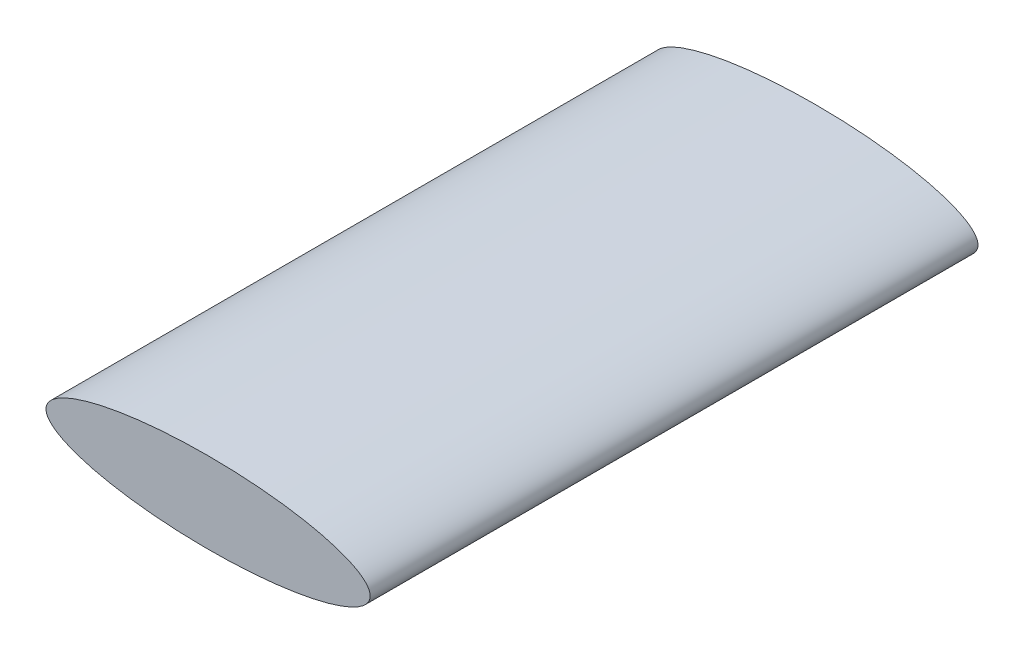
ISO-10303-21;
HEADER;
FILE_DESCRIPTION(('STEP AP214'),'2;1');
FILE_NAME('part.step','',(''),(''),'','','');
FILE_SCHEMA(('AUTOMOTIVE_DESIGN { 1 0 10303 214 1 1 1 1 }'));
ENDSEC;
DATA;
#1=APPLICATION_CONTEXT('core data for automotive mechanical design processes');
#2=APPLICATION_PROTOCOL_DEFINITION('international standard','automotive_design',2000,#1);
#3=PRODUCT_CONTEXT('',#1,'mechanical');
#4=PRODUCT('Part','Part','',(#3));
#5=PRODUCT_RELATED_PRODUCT_CATEGORY('part','',(#4));
#6=PRODUCT_DEFINITION_FORMATION('','',#4);
#7=PRODUCT_DEFINITION_CONTEXT('part definition',#1,'design');
#8=PRODUCT_DEFINITION('design','',#6,#7);
#9=PRODUCT_DEFINITION_SHAPE('','',#8);
#10=(LENGTH_UNIT() NAMED_UNIT(*) SI_UNIT(.MILLI.,.METRE.));
#11=(NAMED_UNIT(*) PLANE_ANGLE_UNIT() SI_UNIT($,.RADIAN.));
#12=(NAMED_UNIT(*) SI_UNIT($,.STERADIAN.) SOLID_ANGLE_UNIT());
#13=UNCERTAINTY_MEASURE_WITH_UNIT(LENGTH_MEASURE(1.E-05),#10,'distance_accuracy_value','');
#14=(GEOMETRIC_REPRESENTATION_CONTEXT(3) GLOBAL_UNCERTAINTY_ASSIGNED_CONTEXT((#13)) GLOBAL_UNIT_ASSIGNED_CONTEXT((#10,
#11,#12)) REPRESENTATION_CONTEXT('',''));
#15=CARTESIAN_POINT('',(0.,0.,0.));
#16=DIRECTION('',(0.,0.,1.));
#17=DIRECTION('',(1.,0.,0.));
#18=AXIS2_PLACEMENT_3D('',#15,#16,#17);
#19=CARTESIAN_POINT('',(1000.,400.,-3000.));
#20=DIRECTION('',(0.,0.,1.));
#21=DIRECTION('',(-1.,0.,0.));
#22=AXIS2_PLACEMENT_3D('',#19,#20,#21);
#23=ELLIPSE('',#22,800.,200.);
#24=DIRECTION('',(0.,0.,1.));
#25=VECTOR('',#24,1.);
#26=SURFACE_OF_LINEAR_EXTRUSION('',#23,#25);
#27=CARTESIAN_POINT('',(200.,400.,-3000.));
#28=VERTEX_POINT('',#27);
#29=EDGE_CURVE('E10',#28,#28,#23,.T.);
#30=ORIENTED_EDGE('',*,*,#29,.T.);
#31=EDGE_LOOP('',(#30));
#32=FACE_BOUND('',#31,.T.);
#33=CARTESIAN_POINT('',(1000.,400.,0.));
#34=DIRECTION('',(0.,0.,1.));
#35=DIRECTION('',(-1.,0.,0.));
#36=AXIS2_PLACEMENT_3D('',#33,#34,#35);
#37=ELLIPSE('',#36,800.,200.);
#38=CARTESIAN_POINT('',(200.,400.,0.));
#39=VERTEX_POINT('',#38);
#40=EDGE_CURVE('E31',#39,#39,#37,.T.);
#41=ORIENTED_EDGE('',*,*,#40,.F.);
#42=EDGE_LOOP('',(#41));
#43=FACE_BOUND('',#42,.T.);
#44=ADVANCED_FACE('F24',(#32,#43),#26,.T.);
#45=CARTESIAN_POINT('',(1000.,400.,-3000.));
#46=DIRECTION('',(0.,0.,1.));
#47=DIRECTION('',(1.,0.,0.));
#48=AXIS2_PLACEMENT_3D('',#45,#46,#47);
#49=PLANE('',#48);
#50=ORIENTED_EDGE('',*,*,#29,.F.);
#51=EDGE_LOOP('',(#50));
#52=FACE_BOUND('',#51,.T.);
#53=ADVANCED_FACE('F40',(#52),#49,.F.);
#54=CARTESIAN_POINT('',(1000.,400.,0.));
#55=DIRECTION('',(0.,0.,1.));
#56=DIRECTION('',(1.,0.,0.));
#57=AXIS2_PLACEMENT_3D('',#54,#55,#56);
#58=PLANE('',#57);
#59=ORIENTED_EDGE('',*,*,#40,.T.);
#60=EDGE_LOOP('',(#59));
#61=FACE_BOUND('',#60,.T.);
#62=ADVANCED_FACE('F37',(#61),#58,.T.);
#63=CLOSED_SHELL('',(#44,#53,#62));
#64=MANIFOLD_SOLID_BREP('B2',#63);
#65=ADVANCED_BREP_SHAPE_REPRESENTATION('',(#18,#64),#14);
#66=SHAPE_DEFINITION_REPRESENTATION(#9,#65);
ENDSEC;
END-ISO-10303-21;
